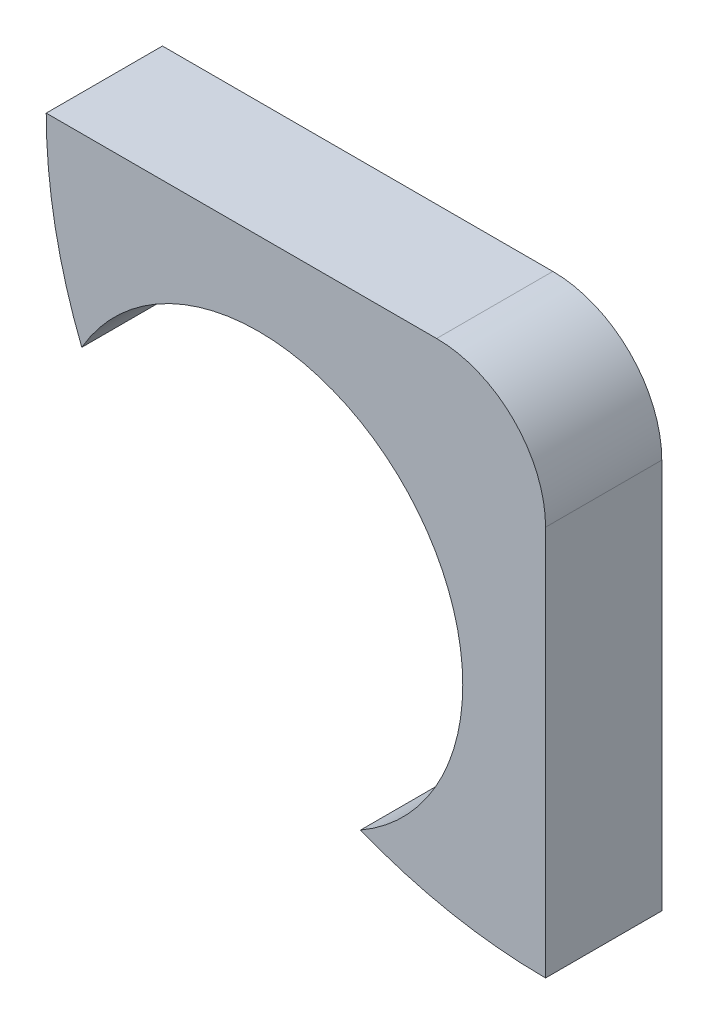
ISO-10303-21;
HEADER;
FILE_DESCRIPTION(('STEP AP214'),'2;1');
FILE_NAME('part.step','',(''),(''),'','','');
FILE_SCHEMA(('AUTOMOTIVE_DESIGN { 1 0 10303 214 1 1 1 1 }'));
ENDSEC;
DATA;
#1=APPLICATION_CONTEXT('core data for automotive mechanical design processes');
#2=APPLICATION_PROTOCOL_DEFINITION('international standard','automotive_design',2000,#1);
#3=PRODUCT_CONTEXT('',#1,'mechanical');
#4=PRODUCT('Part','Part','',(#3));
#5=PRODUCT_RELATED_PRODUCT_CATEGORY('part','',(#4));
#6=PRODUCT_DEFINITION_FORMATION('','',#4);
#7=PRODUCT_DEFINITION_CONTEXT('part definition',#1,'design');
#8=PRODUCT_DEFINITION('design','',#6,#7);
#9=PRODUCT_DEFINITION_SHAPE('','',#8);
#10=(LENGTH_UNIT() NAMED_UNIT(*) SI_UNIT(.MILLI.,.METRE.));
#11=(NAMED_UNIT(*) PLANE_ANGLE_UNIT() SI_UNIT($,.RADIAN.));
#12=(NAMED_UNIT(*) SI_UNIT($,.STERADIAN.) SOLID_ANGLE_UNIT());
#13=UNCERTAINTY_MEASURE_WITH_UNIT(LENGTH_MEASURE(1.E-05),#10,'distance_accuracy_value','');
#14=(GEOMETRIC_REPRESENTATION_CONTEXT(3) GLOBAL_UNCERTAINTY_ASSIGNED_CONTEXT((#13)) GLOBAL_UNIT_ASSIGNED_CONTEXT((#10,
#11,#12)) REPRESENTATION_CONTEXT('',''));
#15=CARTESIAN_POINT('',(0.,0.,0.));
#16=DIRECTION('',(0.,0.,1.));
#17=DIRECTION('',(1.,0.,0.));
#18=AXIS2_PLACEMENT_3D('',#15,#16,#17);
#19=CARTESIAN_POINT('',(18.45,18.45,1.));
#20=DIRECTION('',(0.,0.,-1.));
#21=DIRECTION('',(0.,-1.,0.));
#22=AXIS2_PLACEMENT_3D('',#19,#20,#21);
#23=PLANE('',#22);
#24=CARTESIAN_POINT('',(18.45,18.45,1.));
#25=DIRECTION('',(0.,0.,-1.));
#26=DIRECTION('',(-1.,0.,0.));
#27=AXIS2_PLACEMENT_3D('',#24,#25,#26);
#28=CIRCLE('',#27,1.5);
#29=CARTESIAN_POINT('',(18.45,19.95,1.));
#30=VERTEX_POINT('',#29);
#31=CARTESIAN_POINT('',(19.95,18.45,1.));
#32=VERTEX_POINT('',#31);
#33=EDGE_CURVE('E143',#30,#32,#28,.T.);
#34=ORIENTED_EDGE('',*,*,#33,.F.);
#35=DIRECTION('',(1.,0.,0.));
#36=VECTOR('',#35,1.);
#37=CARTESIAN_POINT('',(13.0749999999998,19.95,1.));
#38=LINE('',#37,#36);
#39=CARTESIAN_POINT('',(13.0749999999998,19.95,1.));
#40=VERTEX_POINT('',#39);
#41=EDGE_CURVE('E20',#40,#30,#38,.T.);
#42=ORIENTED_EDGE('',*,*,#41,.F.);
#43=CARTESIAN_POINT('',(19.95,19.95,1.));
#44=DIRECTION('',(0.,0.,-1.));
#45=DIRECTION('',(-1.,0.,0.));
#46=AXIS2_PLACEMENT_3D('',#43,#44,#45);
#47=CIRCLE('',#46,6.875);
#48=CARTESIAN_POINT('',(13.564657480385,17.4018583423996,1.));
#49=VERTEX_POINT('',#48);
#50=EDGE_CURVE('E138',#49,#40,#47,.T.);
#51=ORIENTED_EDGE('',*,*,#50,.F.);
#52=CARTESIAN_POINT('',(16.,16.,1.));
#53=DIRECTION('',(0.,0.,1.));
#54=DIRECTION('',(-1.,0.,0.));
#55=AXIS2_PLACEMENT_3D('',#52,#53,#54);
#56=CIRCLE('',#55,2.81);
#57=CARTESIAN_POINT('',(18.81,16.,1.));
#58=VERTEX_POINT('',#57);
#59=EDGE_CURVE('E121',#58,#49,#56,.T.);
#60=ORIENTED_EDGE('',*,*,#59,.F.);
#61=CARTESIAN_POINT('',(16.,16.,1.));
#62=DIRECTION('',(0.,0.,1.));
#63=DIRECTION('',(-1.,0.,0.));
#64=AXIS2_PLACEMENT_3D('',#61,#62,#63);
#65=CIRCLE('',#64,2.81);
#66=CARTESIAN_POINT('',(17.4018583423999,13.5646574803852,1.));
#67=VERTEX_POINT('',#66);
#68=EDGE_CURVE('E112',#67,#58,#65,.T.);
#69=ORIENTED_EDGE('',*,*,#68,.F.);
#70=CARTESIAN_POINT('',(19.95,19.95,1.));
#71=DIRECTION('',(0.,0.,-1.));
#72=DIRECTION('',(-1.,0.,0.));
#73=AXIS2_PLACEMENT_3D('',#70,#71,#72);
#74=CIRCLE('',#73,6.875);
#75=CARTESIAN_POINT('',(19.95,13.0750000000002,1.));
#76=VERTEX_POINT('',#75);
#77=EDGE_CURVE('E79',#76,#67,#74,.T.);
#78=ORIENTED_EDGE('',*,*,#77,.F.);
#79=DIRECTION('',(0.,-1.,0.));
#80=VECTOR('',#79,1.);
#81=CARTESIAN_POINT('',(19.95,18.45,1.));
#82=LINE('',#81,#80);
#83=EDGE_CURVE('E163',#32,#76,#82,.T.);
#84=ORIENTED_EDGE('',*,*,#83,.F.);
#85=EDGE_LOOP('',(#34,#42,#51,#60,#69,#78,#84));
#86=FACE_BOUND('',#85,.T.);
#87=ADVANCED_FACE('F16',(#86),#23,.F.);
#88=CARTESIAN_POINT('',(18.45,18.45,-0.6));
#89=DIRECTION('',(0.,0.,-1.));
#90=DIRECTION('',(0.,-1.,0.));
#91=AXIS2_PLACEMENT_3D('',#88,#89,#90);
#92=PLANE('',#91);
#93=CARTESIAN_POINT('',(18.45,18.45,-0.6));
#94=DIRECTION('',(0.,0.,-1.));
#95=DIRECTION('',(-1.,0.,0.));
#96=AXIS2_PLACEMENT_3D('',#93,#94,#95);
#97=CIRCLE('',#96,1.5);
#98=CARTESIAN_POINT('',(18.45,19.95,-0.6));
#99=VERTEX_POINT('',#98);
#100=CARTESIAN_POINT('',(19.95,18.45,-0.6));
#101=VERTEX_POINT('',#100);
#102=EDGE_CURVE('E142',#99,#101,#97,.T.);
#103=ORIENTED_EDGE('',*,*,#102,.T.);
#104=DIRECTION('',(0.,-1.,0.));
#105=VECTOR('',#104,1.);
#106=CARTESIAN_POINT('',(19.95,18.45,-0.6));
#107=LINE('',#106,#105);
#108=CARTESIAN_POINT('',(19.95,13.0750000000002,-0.6));
#109=VERTEX_POINT('',#108);
#110=EDGE_CURVE('E136',#101,#109,#107,.T.);
#111=ORIENTED_EDGE('',*,*,#110,.T.);
#112=CARTESIAN_POINT('',(19.95,19.95,-0.6));
#113=DIRECTION('',(0.,0.,-1.));
#114=DIRECTION('',(-1.,0.,0.));
#115=AXIS2_PLACEMENT_3D('',#112,#113,#114);
#116=CIRCLE('',#115,6.875);
#117=CARTESIAN_POINT('',(17.4018583423999,13.5646574803852,-0.6));
#118=VERTEX_POINT('',#117);
#119=EDGE_CURVE('E64',#109,#118,#116,.T.);
#120=ORIENTED_EDGE('',*,*,#119,.T.);
#121=CARTESIAN_POINT('',(16.,16.,-0.6));
#122=DIRECTION('',(0.,0.,1.));
#123=DIRECTION('',(-1.,0.,0.));
#124=AXIS2_PLACEMENT_3D('',#121,#122,#123);
#125=CIRCLE('',#124,2.81);
#126=CARTESIAN_POINT('',(18.81,16.,-0.6));
#127=VERTEX_POINT('',#126);
#128=EDGE_CURVE('E103',#118,#127,#125,.T.);
#129=ORIENTED_EDGE('',*,*,#128,.T.);
#130=CARTESIAN_POINT('',(16.,16.,-0.6));
#131=DIRECTION('',(0.,0.,1.));
#132=DIRECTION('',(-1.,0.,0.));
#133=AXIS2_PLACEMENT_3D('',#130,#131,#132);
#134=CIRCLE('',#133,2.81);
#135=CARTESIAN_POINT('',(13.564657480385,17.4018583423996,-0.6));
#136=VERTEX_POINT('',#135);
#137=EDGE_CURVE('E108',#127,#136,#134,.T.);
#138=ORIENTED_EDGE('',*,*,#137,.T.);
#139=CARTESIAN_POINT('',(19.95,19.95,-0.6));
#140=DIRECTION('',(0.,0.,-1.));
#141=DIRECTION('',(-1.,0.,0.));
#142=AXIS2_PLACEMENT_3D('',#139,#140,#141);
#143=CIRCLE('',#142,6.875);
#144=CARTESIAN_POINT('',(13.0749999999998,19.95,-0.6));
#145=VERTEX_POINT('',#144);
#146=EDGE_CURVE('E92',#136,#145,#143,.T.);
#147=ORIENTED_EDGE('',*,*,#146,.T.);
#148=DIRECTION('',(1.,0.,0.));
#149=VECTOR('',#148,1.);
#150=CARTESIAN_POINT('',(13.0749999999998,19.95,-0.6));
#151=LINE('',#150,#149);
#152=EDGE_CURVE('E11',#145,#99,#151,.T.);
#153=ORIENTED_EDGE('',*,*,#152,.T.);
#154=EDGE_LOOP('',(#103,#111,#120,#129,#138,#147,#153));
#155=FACE_BOUND('',#154,.T.);
#156=ADVANCED_FACE('F106',(#155),#92,.T.);
#157=CARTESIAN_POINT('',(13.0749999999998,19.95,-0.6));
#158=DIRECTION('',(0.,-1.,0.));
#159=DIRECTION('',(0.,0.,-1.));
#160=AXIS2_PLACEMENT_3D('',#157,#158,#159);
#161=PLANE('',#160);
#162=ORIENTED_EDGE('',*,*,#41,.T.);
#163=DIRECTION('',(0.,0.,1.));
#164=VECTOR('',#163,1.);
#165=CARTESIAN_POINT('',(18.45,19.95,-0.6));
#166=LINE('',#165,#164);
#167=EDGE_CURVE('E153',#99,#30,#166,.T.);
#168=ORIENTED_EDGE('',*,*,#167,.F.);
#169=ORIENTED_EDGE('',*,*,#152,.F.);
#170=DIRECTION('',(0.,0.,1.));
#171=VECTOR('',#170,1.);
#172=CARTESIAN_POINT('',(13.0749999999998,19.95,-0.6));
#173=LINE('',#172,#171);
#174=EDGE_CURVE('E167',#145,#40,#173,.T.);
#175=ORIENTED_EDGE('',*,*,#174,.T.);
#176=EDGE_LOOP('',(#162,#168,#169,#175));
#177=FACE_BOUND('',#176,.T.);
#178=ADVANCED_FACE('F292',(#177),#161,.F.);
#179=CARTESIAN_POINT('',(19.95,19.95,-0.6));
#180=DIRECTION('',(0.,0.,1.));
#181=DIRECTION('',(1.,0.,0.));
#182=AXIS2_PLACEMENT_3D('',#179,#180,#181);
#183=CYLINDRICAL_SURFACE('',#182,6.875);
#184=ORIENTED_EDGE('',*,*,#50,.T.);
#185=ORIENTED_EDGE('',*,*,#174,.F.);
#186=ORIENTED_EDGE('',*,*,#146,.F.);
#187=DIRECTION('',(0.,0.,1.));
#188=VECTOR('',#187,1.);
#189=CARTESIAN_POINT('',(13.564657480385,17.4018583423996,-0.6));
#190=LINE('',#189,#188);
#191=EDGE_CURVE('E124',#136,#49,#190,.T.);
#192=ORIENTED_EDGE('',*,*,#191,.T.);
#193=EDGE_LOOP('',(#184,#185,#186,#192));
#194=FACE_BOUND('',#193,.T.);
#195=ADVANCED_FACE('F295',(#194),#183,.T.);
#196=CARTESIAN_POINT('',(16.,16.,-0.6));
#197=DIRECTION('',(0.,0.,1.));
#198=DIRECTION('',(1.,0.,0.));
#199=AXIS2_PLACEMENT_3D('',#196,#197,#198);
#200=CYLINDRICAL_SURFACE('',#199,2.81);
#201=DIRECTION('',(0.,0.,1.));
#202=VECTOR('',#201,1.);
#203=CARTESIAN_POINT('',(18.81,16.,-0.6));
#204=LINE('',#203,#202);
#205=EDGE_CURVE('E115',#127,#58,#204,.T.);
#206=ORIENTED_EDGE('',*,*,#205,.F.);
#207=ORIENTED_EDGE('',*,*,#128,.F.);
#208=DIRECTION('',(0.,0.,1.));
#209=VECTOR('',#208,1.);
#210=CARTESIAN_POINT('',(17.4018583423999,13.5646574803852,-0.6));
#211=LINE('',#210,#209);
#212=EDGE_CURVE('E135',#118,#67,#211,.T.);
#213=ORIENTED_EDGE('',*,*,#212,.T.);
#214=ORIENTED_EDGE('',*,*,#68,.T.);
#215=EDGE_LOOP('',(#206,#207,#213,#214));
#216=FACE_BOUND('',#215,.T.);
#217=ADVANCED_FACE('F116',(#216),#200,.F.);
#218=CARTESIAN_POINT('',(19.95,19.95,-0.6));
#219=DIRECTION('',(0.,0.,1.));
#220=DIRECTION('',(1.,0.,0.));
#221=AXIS2_PLACEMENT_3D('',#218,#219,#220);
#222=CYLINDRICAL_SURFACE('',#221,6.875);
#223=ORIENTED_EDGE('',*,*,#77,.T.);
#224=ORIENTED_EDGE('',*,*,#212,.F.);
#225=ORIENTED_EDGE('',*,*,#119,.F.);
#226=DIRECTION('',(0.,0.,1.));
#227=VECTOR('',#226,1.);
#228=CARTESIAN_POINT('',(19.95,13.0750000000002,-0.6));
#229=LINE('',#228,#227);
#230=EDGE_CURVE('E179',#109,#76,#229,.T.);
#231=ORIENTED_EDGE('',*,*,#230,.T.);
#232=EDGE_LOOP('',(#223,#224,#225,#231));
#233=FACE_BOUND('',#232,.T.);
#234=ADVANCED_FACE('F18',(#233),#222,.T.);
#235=CARTESIAN_POINT('',(19.95,18.45,-0.6));
#236=DIRECTION('',(-1.,0.,0.));
#237=DIRECTION('',(0.,0.,1.));
#238=AXIS2_PLACEMENT_3D('',#235,#236,#237);
#239=PLANE('',#238);
#240=ORIENTED_EDGE('',*,*,#83,.T.);
#241=ORIENTED_EDGE('',*,*,#230,.F.);
#242=ORIENTED_EDGE('',*,*,#110,.F.);
#243=DIRECTION('',(0.,0.,1.));
#244=VECTOR('',#243,1.);
#245=CARTESIAN_POINT('',(19.95,18.45,-0.6));
#246=LINE('',#245,#244);
#247=EDGE_CURVE('E139',#101,#32,#246,.T.);
#248=ORIENTED_EDGE('',*,*,#247,.T.);
#249=EDGE_LOOP('',(#240,#241,#242,#248));
#250=FACE_BOUND('',#249,.T.);
#251=ADVANCED_FACE('F191',(#250),#239,.F.);
#252=CARTESIAN_POINT('',(18.45,18.45,-0.6));
#253=DIRECTION('',(0.,0.,1.));
#254=DIRECTION('',(1.,0.,0.));
#255=AXIS2_PLACEMENT_3D('',#252,#253,#254);
#256=CYLINDRICAL_SURFACE('',#255,1.5);
#257=ORIENTED_EDGE('',*,*,#33,.T.);
#258=ORIENTED_EDGE('',*,*,#247,.F.);
#259=ORIENTED_EDGE('',*,*,#102,.F.);
#260=ORIENTED_EDGE('',*,*,#167,.T.);
#261=EDGE_LOOP('',(#257,#258,#259,#260));
#262=FACE_BOUND('',#261,.T.);
#263=ADVANCED_FACE('F273',(#262),#256,.T.);
#264=CARTESIAN_POINT('',(16.,16.,-0.6));
#265=DIRECTION('',(0.,0.,1.));
#266=DIRECTION('',(1.,0.,0.));
#267=AXIS2_PLACEMENT_3D('',#264,#265,#266);
#268=CYLINDRICAL_SURFACE('',#267,2.81);
#269=ORIENTED_EDGE('',*,*,#137,.F.);
#270=ORIENTED_EDGE('',*,*,#205,.T.);
#271=ORIENTED_EDGE('',*,*,#59,.T.);
#272=ORIENTED_EDGE('',*,*,#191,.F.);
#273=EDGE_LOOP('',(#269,#270,#271,#272));
#274=FACE_BOUND('',#273,.T.);
#275=ADVANCED_FACE('F123',(#274),#268,.F.);
#276=CLOSED_SHELL('',(#87,#156,#178,#195,#217,#234,#251,#263,#275));
#277=MANIFOLD_SOLID_BREP('B1',#276);
#278=ADVANCED_BREP_SHAPE_REPRESENTATION('',(#18,#277),#14);
#279=SHAPE_DEFINITION_REPRESENTATION(#9,#278);
ENDSEC;
END-ISO-10303-21;
